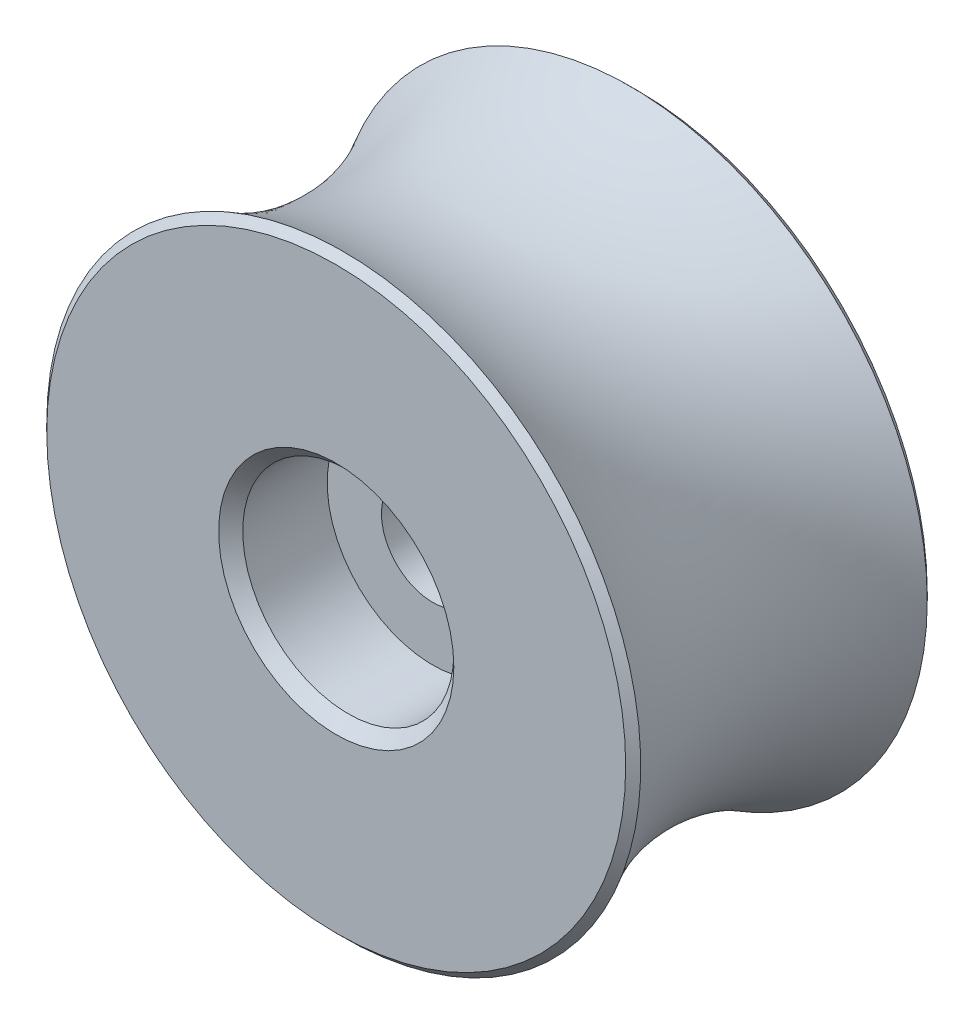
ISO-10303-21;
HEADER;
FILE_DESCRIPTION(('STEP AP214'),'2;1');
FILE_NAME('part.step','',(''),(''),'','','');
FILE_SCHEMA(('AUTOMOTIVE_DESIGN { 1 0 10303 214 1 1 1 1 }'));
ENDSEC;
DATA;
#1=APPLICATION_CONTEXT('core data for automotive mechanical design processes');
#2=APPLICATION_PROTOCOL_DEFINITION('international standard','automotive_design',2000,#1);
#3=PRODUCT_CONTEXT('',#1,'mechanical');
#4=PRODUCT('Part','Part','',(#3));
#5=PRODUCT_RELATED_PRODUCT_CATEGORY('part','',(#4));
#6=PRODUCT_DEFINITION_FORMATION('','',#4);
#7=PRODUCT_DEFINITION_CONTEXT('part definition',#1,'design');
#8=PRODUCT_DEFINITION('design','',#6,#7);
#9=PRODUCT_DEFINITION_SHAPE('','',#8);
#10=(LENGTH_UNIT() NAMED_UNIT(*) SI_UNIT(.MILLI.,.METRE.));
#11=(NAMED_UNIT(*) PLANE_ANGLE_UNIT() SI_UNIT($,.RADIAN.));
#12=(NAMED_UNIT(*) SI_UNIT($,.STERADIAN.) SOLID_ANGLE_UNIT());
#13=UNCERTAINTY_MEASURE_WITH_UNIT(LENGTH_MEASURE(1.E-05),#10,'distance_accuracy_value','');
#14=(GEOMETRIC_REPRESENTATION_CONTEXT(3) GLOBAL_UNCERTAINTY_ASSIGNED_CONTEXT((#13)) GLOBAL_UNIT_ASSIGNED_CONTEXT((#10,
#11,#12)) REPRESENTATION_CONTEXT('',''));
#15=CARTESIAN_POINT('',(0.,0.,0.));
#16=DIRECTION('',(0.,0.,1.));
#17=DIRECTION('',(1.,0.,0.));
#18=AXIS2_PLACEMENT_3D('',#15,#16,#17);
#19=CARTESIAN_POINT('',(0.,0.,-0.000999999999999265));
#20=DIRECTION('',(0.,0.,1.));
#21=DIRECTION('',(1.,0.,0.));
#22=AXIS2_PLACEMENT_3D('',#19,#20,#21);
#23=CYLINDRICAL_SURFACE('',#22,1.7);
#24=CARTESIAN_POINT('',(0.,0.,6.8));
#25=DIRECTION('',(0.,0.,1.));
#26=DIRECTION('',(1.,0.,0.));
#27=AXIS2_PLACEMENT_3D('',#24,#25,#26);
#28=CIRCLE('',#27,1.7);
#29=CARTESIAN_POINT('',(1.7,0.,6.8));
#30=VERTEX_POINT('',#29);
#31=EDGE_CURVE('E89',#30,#30,#28,.F.);
#32=ORIENTED_EDGE('',*,*,#31,.F.);
#33=EDGE_LOOP('',(#32));
#34=FACE_BOUND('',#33,.T.);
#35=CARTESIAN_POINT('',(0.,0.,3.2));
#36=DIRECTION('',(0.,0.,-1.));
#37=DIRECTION('',(-1.,0.,0.));
#38=AXIS2_PLACEMENT_3D('',#35,#36,#37);
#39=CIRCLE('',#38,1.7);
#40=CARTESIAN_POINT('',(-1.7,0.,3.2));
#41=VERTEX_POINT('',#40);
#42=EDGE_CURVE('E90',#41,#41,#39,.F.);
#43=ORIENTED_EDGE('',*,*,#42,.F.);
#44=EDGE_LOOP('',(#43));
#45=FACE_BOUND('',#44,.T.);
#46=ADVANCED_FACE('F45',(#34,#45),#23,.F.);
#47=CARTESIAN_POINT('',(0.,0.,10.));
#48=DIRECTION('',(0.,0.,1.));
#49=DIRECTION('',(1.,0.,0.));
#50=AXIS2_PLACEMENT_3D('',#47,#48,#49);
#51=PLANE('',#50);
#52=CARTESIAN_POINT('',(0.,0.,10.));
#53=DIRECTION('',(0.,0.,1.));
#54=DIRECTION('',(1.,0.,0.));
#55=AXIS2_PLACEMENT_3D('',#52,#53,#54);
#56=CIRCLE('',#55,9.6);
#57=CARTESIAN_POINT('',(9.6,0.,10.));
#58=VERTEX_POINT('',#57);
#59=EDGE_CURVE('E78',#58,#58,#56,.T.);
#60=ORIENTED_EDGE('',*,*,#59,.T.);
#61=EDGE_LOOP('',(#60));
#62=FACE_BOUND('',#61,.T.);
#63=CARTESIAN_POINT('',(0.,0.,10.));
#64=DIRECTION('',(0.,0.,1.));
#65=DIRECTION('',(1.,0.,0.));
#66=AXIS2_PLACEMENT_3D('',#63,#64,#65);
#67=CIRCLE('',#66,3.9);
#68=CARTESIAN_POINT('',(3.9,0.,10.));
#69=VERTEX_POINT('',#68);
#70=EDGE_CURVE('E81',#69,#69,#67,.F.);
#71=ORIENTED_EDGE('',*,*,#70,.T.);
#72=EDGE_LOOP('',(#71));
#73=FACE_BOUND('',#72,.T.);
#74=ADVANCED_FACE('F116',(#62,#73),#51,.T.);
#75=CARTESIAN_POINT('',(0.,0.,0.));
#76=DIRECTION('',(0.,0.,1.));
#77=DIRECTION('',(1.,0.,0.));
#78=AXIS2_PLACEMENT_3D('',#75,#76,#77);
#79=PLANE('',#78);
#80=CARTESIAN_POINT('',(0.,0.,0.));
#81=DIRECTION('',(0.,0.,1.));
#82=DIRECTION('',(1.,0.,0.));
#83=AXIS2_PLACEMENT_3D('',#80,#81,#82);
#84=CIRCLE('',#83,9.6);
#85=CARTESIAN_POINT('',(9.6,0.,0.));
#86=VERTEX_POINT('',#85);
#87=EDGE_CURVE('E54',#86,#86,#84,.F.);
#88=ORIENTED_EDGE('',*,*,#87,.T.);
#89=EDGE_LOOP('',(#88));
#90=FACE_BOUND('',#89,.T.);
#91=CARTESIAN_POINT('',(0.,0.,0.));
#92=DIRECTION('',(0.,0.,1.));
#93=DIRECTION('',(1.,0.,0.));
#94=AXIS2_PLACEMENT_3D('',#91,#92,#93);
#95=CIRCLE('',#94,3.9);
#96=CARTESIAN_POINT('',(3.9,0.,0.));
#97=VERTEX_POINT('',#96);
#98=EDGE_CURVE('E68',#97,#97,#95,.T.);
#99=ORIENTED_EDGE('',*,*,#98,.T.);
#100=EDGE_LOOP('',(#99));
#101=FACE_BOUND('',#100,.T.);
#102=ADVANCED_FACE('F122',(#90,#101),#79,.F.);
#103=CARTESIAN_POINT('',(0.,0.,6.8));
#104=DIRECTION('',(0.,0.,1.));
#105=DIRECTION('',(1.,0.,0.));
#106=AXIS2_PLACEMENT_3D('',#103,#104,#105);
#107=PLANE('',#106);
#108=CARTESIAN_POINT('',(0.,0.,6.8));
#109=DIRECTION('',(0.,0.,1.));
#110=DIRECTION('',(1.,0.,0.));
#111=AXIS2_PLACEMENT_3D('',#108,#109,#110);
#112=CIRCLE('',#111,3.5);
#113=CARTESIAN_POINT('',(3.5,0.,6.8));
#114=VERTEX_POINT('',#113);
#115=EDGE_CURVE('E93',#114,#114,#112,.T.);
#116=ORIENTED_EDGE('',*,*,#115,.T.);
#117=EDGE_LOOP('',(#116));
#118=FACE_BOUND('',#117,.T.);
#119=ORIENTED_EDGE('',*,*,#31,.T.);
#120=EDGE_LOOP('',(#119));
#121=FACE_BOUND('',#120,.T.);
#122=ADVANCED_FACE('F131',(#118,#121),#107,.T.);
#123=CARTESIAN_POINT('',(0.,0.,6.8));
#124=DIRECTION('',(0.,0.,1.));
#125=DIRECTION('',(1.,0.,0.));
#126=AXIS2_PLACEMENT_3D('',#123,#124,#125);
#127=CYLINDRICAL_SURFACE('',#126,3.5);
#128=CARTESIAN_POINT('',(0.,0.,9.6));
#129=DIRECTION('',(0.,0.,1.));
#130=DIRECTION('',(1.,0.,0.));
#131=AXIS2_PLACEMENT_3D('',#128,#129,#130);
#132=CIRCLE('',#131,3.5);
#133=CARTESIAN_POINT('',(3.5,0.,9.6));
#134=VERTEX_POINT('',#133);
#135=EDGE_CURVE('E74',#134,#134,#132,.T.);
#136=ORIENTED_EDGE('',*,*,#135,.T.);
#137=EDGE_LOOP('',(#136));
#138=FACE_BOUND('',#137,.T.);
#139=ORIENTED_EDGE('',*,*,#115,.F.);
#140=EDGE_LOOP('',(#139));
#141=FACE_BOUND('',#140,.T.);
#142=ADVANCED_FACE('F111',(#138,#141),#127,.F.);
#143=CARTESIAN_POINT('',(0.,0.,3.2));
#144=DIRECTION('',(0.,0.,-1.));
#145=DIRECTION('',(1.,0.,0.));
#146=AXIS2_PLACEMENT_3D('',#143,#144,#145);
#147=PLANE('',#146);
#148=CARTESIAN_POINT('',(0.,0.,3.2));
#149=DIRECTION('',(0.,0.,1.));
#150=DIRECTION('',(1.,0.,0.));
#151=AXIS2_PLACEMENT_3D('',#148,#149,#150);
#152=CIRCLE('',#151,3.5);
#153=CARTESIAN_POINT('',(3.5,0.,3.2));
#154=VERTEX_POINT('',#153);
#155=EDGE_CURVE('E94',#154,#154,#152,.T.);
#156=ORIENTED_EDGE('',*,*,#155,.F.);
#157=EDGE_LOOP('',(#156));
#158=FACE_BOUND('',#157,.T.);
#159=ORIENTED_EDGE('',*,*,#42,.T.);
#160=EDGE_LOOP('',(#159));
#161=FACE_BOUND('',#160,.T.);
#162=ADVANCED_FACE('F108',(#158,#161),#147,.T.);
#163=CARTESIAN_POINT('',(0.,0.,3.2));
#164=DIRECTION('',(0.,0.,-1.));
#165=DIRECTION('',(-1.,0.,0.));
#166=AXIS2_PLACEMENT_3D('',#163,#164,#165);
#167=CYLINDRICAL_SURFACE('',#166,3.5);
#168=CARTESIAN_POINT('',(0.,0.,0.400000000000004));
#169=DIRECTION('',(0.,0.,1.));
#170=DIRECTION('',(1.,0.,0.));
#171=AXIS2_PLACEMENT_3D('',#168,#169,#170);
#172=CIRCLE('',#171,3.5);
#173=CARTESIAN_POINT('',(3.5,0.,0.400000000000004));
#174=VERTEX_POINT('',#173);
#175=EDGE_CURVE('E61',#174,#174,#172,.F.);
#176=ORIENTED_EDGE('',*,*,#175,.T.);
#177=EDGE_LOOP('',(#176));
#178=FACE_BOUND('',#177,.T.);
#179=ORIENTED_EDGE('',*,*,#155,.T.);
#180=EDGE_LOOP('',(#179));
#181=FACE_BOUND('',#180,.T.);
#182=ADVANCED_FACE('F106',(#178,#181),#167,.F.);
#183=CARTESIAN_POINT('',(0.,0.,5.));
#184=DIRECTION('',(0.,0.,-1.));
#185=DIRECTION('',(-1.,0.,0.));
#186=AXIS2_PLACEMENT_3D('',#183,#184,#185);
#187=TOROIDAL_SURFACE('',#186,18.0000000000001,9.43398113205665);
#188=CARTESIAN_POINT('',(0.,0.,0.249418630851943));
#189=DIRECTION('',(0.,0.,1.));
#190=DIRECTION('',(1.,0.,0.));
#191=AXIS2_PLACEMENT_3D('',#188,#189,#190);
#192=CIRCLE('',#191,9.84941863085194);
#193=CARTESIAN_POINT('',(9.84941863085194,0.,0.249418630851943));
#194=VERTEX_POINT('',#193);
#195=EDGE_CURVE('E10',#194,#194,#192,.T.);
#196=ORIENTED_EDGE('',*,*,#195,.T.);
#197=EDGE_LOOP('',(#196));
#198=FACE_BOUND('',#197,.T.);
#199=CARTESIAN_POINT('',(0.,0.,9.75058136914806));
#200=DIRECTION('',(0.,0.,-1.));
#201=DIRECTION('',(-1.,0.,0.));
#202=AXIS2_PLACEMENT_3D('',#199,#200,#201);
#203=CIRCLE('',#202,9.84941863085194);
#204=CARTESIAN_POINT('',(-9.84941863085194,0.,9.75058136914806));
#205=VERTEX_POINT('',#204);
#206=EDGE_CURVE('E85',#205,#205,#203,.T.);
#207=ORIENTED_EDGE('',*,*,#206,.T.);
#208=EDGE_LOOP('',(#207));
#209=FACE_BOUND('',#208,.T.);
#210=ADVANCED_FACE('F140',(#198,#209),#187,.F.);
#211=CARTESIAN_POINT('',(0.,0.,9.75058136914805));
#212=DIRECTION('',(0.,0.,-1.));
#213=DIRECTION('',(-1.,0.,0.));
#214=AXIS2_PLACEMENT_3D('',#211,#212,#213);
#215=CONICAL_SURFACE('',#214,9.84941863085194,0.785398163397445);
#216=ORIENTED_EDGE('',*,*,#59,.F.);
#217=EDGE_LOOP('',(#216));
#218=FACE_BOUND('',#217,.T.);
#219=ORIENTED_EDGE('',*,*,#206,.F.);
#220=EDGE_LOOP('',(#219));
#221=FACE_BOUND('',#220,.T.);
#222=ADVANCED_FACE('F133',(#218,#221),#215,.T.);
#223=CARTESIAN_POINT('',(0.,0.,9.6));
#224=DIRECTION('',(0.,0.,1.));
#225=DIRECTION('',(1.,0.,0.));
#226=AXIS2_PLACEMENT_3D('',#223,#224,#225);
#227=CONICAL_SURFACE('',#226,3.5,0.785398163397452);
#228=ORIENTED_EDGE('',*,*,#70,.F.);
#229=EDGE_LOOP('',(#228));
#230=FACE_BOUND('',#229,.T.);
#231=ORIENTED_EDGE('',*,*,#135,.F.);
#232=EDGE_LOOP('',(#231));
#233=FACE_BOUND('',#232,.T.);
#234=ADVANCED_FACE('F139',(#230,#233),#227,.F.);
#235=CARTESIAN_POINT('',(0.,0.,0.));
#236=DIRECTION('',(0.,0.,-1.));
#237=DIRECTION('',(-1.,0.,0.));
#238=AXIS2_PLACEMENT_3D('',#235,#236,#237);
#239=CONICAL_SURFACE('',#238,3.9,0.785398163397449);
#240=ORIENTED_EDGE('',*,*,#175,.F.);
#241=EDGE_LOOP('',(#240));
#242=FACE_BOUND('',#241,.T.);
#243=ORIENTED_EDGE('',*,*,#98,.F.);
#244=EDGE_LOOP('',(#243));
#245=FACE_BOUND('',#244,.T.);
#246=ADVANCED_FACE('F146',(#242,#245),#239,.F.);
#247=CARTESIAN_POINT('',(0.,0.,0.));
#248=DIRECTION('',(0.,0.,1.));
#249=DIRECTION('',(1.,0.,0.));
#250=AXIS2_PLACEMENT_3D('',#247,#248,#249);
#251=CONICAL_SURFACE('',#250,9.6,0.78539816339745);
#252=ORIENTED_EDGE('',*,*,#195,.F.);
#253=EDGE_LOOP('',(#252));
#254=FACE_BOUND('',#253,.T.);
#255=ORIENTED_EDGE('',*,*,#87,.F.);
#256=EDGE_LOOP('',(#255));
#257=FACE_BOUND('',#256,.T.);
#258=ADVANCED_FACE('F48',(#254,#257),#251,.T.);
#259=CLOSED_SHELL('',(#46,#74,#102,#122,#142,#162,#182,#210,#222,#234,#246,#258));
#260=MANIFOLD_SOLID_BREP('B2',#259);
#261=ADVANCED_BREP_SHAPE_REPRESENTATION('',(#18,#260),#14);
#262=SHAPE_DEFINITION_REPRESENTATION(#9,#261);
ENDSEC;
END-ISO-10303-21;
